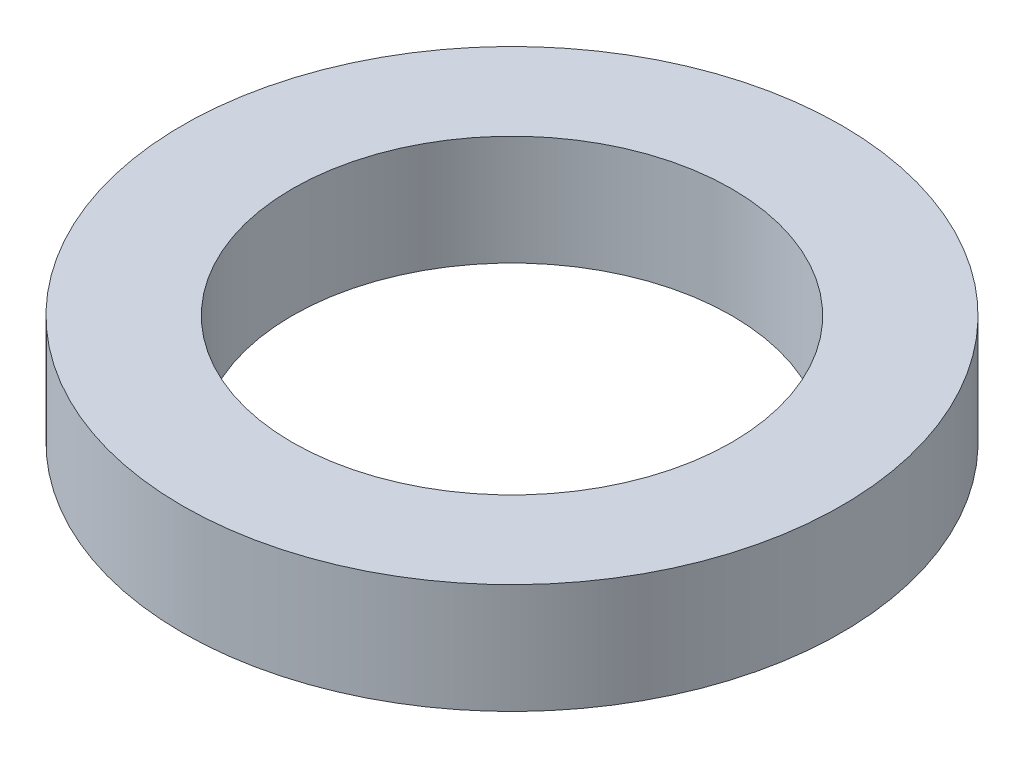
ISO-10303-21;
HEADER;
FILE_DESCRIPTION(('STEP AP214'),'2;1');
FILE_NAME('part.step','',(''),(''),'','','');
FILE_SCHEMA(('AUTOMOTIVE_DESIGN { 1 0 10303 214 1 1 1 1 }'));
ENDSEC;
DATA;
#1=APPLICATION_CONTEXT('core data for automotive mechanical design processes');
#2=APPLICATION_PROTOCOL_DEFINITION('international standard','automotive_design',2000,#1);
#3=PRODUCT_CONTEXT('',#1,'mechanical');
#4=PRODUCT('Part','Part','',(#3));
#5=PRODUCT_RELATED_PRODUCT_CATEGORY('part','',(#4));
#6=PRODUCT_DEFINITION_FORMATION('','',#4);
#7=PRODUCT_DEFINITION_CONTEXT('part definition',#1,'design');
#8=PRODUCT_DEFINITION('design','',#6,#7);
#9=PRODUCT_DEFINITION_SHAPE('','',#8);
#10=(LENGTH_UNIT() NAMED_UNIT(*) SI_UNIT(.MILLI.,.METRE.));
#11=(NAMED_UNIT(*) PLANE_ANGLE_UNIT() SI_UNIT($,.RADIAN.));
#12=(NAMED_UNIT(*) SI_UNIT($,.STERADIAN.) SOLID_ANGLE_UNIT());
#13=UNCERTAINTY_MEASURE_WITH_UNIT(LENGTH_MEASURE(1.E-05),#10,'distance_accuracy_value','');
#14=(GEOMETRIC_REPRESENTATION_CONTEXT(3) GLOBAL_UNCERTAINTY_ASSIGNED_CONTEXT((#13)) GLOBAL_UNIT_ASSIGNED_CONTEXT((#10,
#11,#12)) REPRESENTATION_CONTEXT('',''));
#15=CARTESIAN_POINT('',(0.,0.,0.));
#16=DIRECTION('',(0.,0.,1.));
#17=DIRECTION('',(1.,0.,0.));
#18=AXIS2_PLACEMENT_3D('',#15,#16,#17);
#19=CARTESIAN_POINT('',(0.,3.175,0.));
#20=DIRECTION('',(0.,-1.,0.));
#21=DIRECTION('',(0.,0.,-1.));
#22=AXIS2_PLACEMENT_3D('',#19,#20,#21);
#23=CYLINDRICAL_SURFACE('',#22,9.525);
#24=CARTESIAN_POINT('',(0.,3.175,0.));
#25=DIRECTION('',(0.,1.,0.));
#26=DIRECTION('',(0.,0.,1.));
#27=AXIS2_PLACEMENT_3D('',#24,#25,#26);
#28=CIRCLE('',#27,9.525);
#29=CARTESIAN_POINT('',(0.,3.175,9.525));
#30=VERTEX_POINT('',#29);
#31=EDGE_CURVE('E10',#30,#30,#28,.T.);
#32=ORIENTED_EDGE('',*,*,#31,.F.);
#33=EDGE_LOOP('',(#32));
#34=FACE_BOUND('',#33,.T.);
#35=CARTESIAN_POINT('',(0.,0.,0.));
#36=DIRECTION('',(0.,1.,0.));
#37=DIRECTION('',(0.,0.,1.));
#38=AXIS2_PLACEMENT_3D('',#35,#36,#37);
#39=CIRCLE('',#38,9.525);
#40=CARTESIAN_POINT('',(0.,0.,9.525));
#41=VERTEX_POINT('',#40);
#42=EDGE_CURVE('E33',#41,#41,#39,.T.);
#43=ORIENTED_EDGE('',*,*,#42,.T.);
#44=EDGE_LOOP('',(#43));
#45=FACE_BOUND('',#44,.T.);
#46=ADVANCED_FACE('F30',(#34,#45),#23,.T.);
#47=CARTESIAN_POINT('',(0.,3.175,0.));
#48=DIRECTION('',(0.,1.,0.));
#49=DIRECTION('',(0.,0.,1.));
#50=AXIS2_PLACEMENT_3D('',#47,#48,#49);
#51=PLANE('',#50);
#52=CARTESIAN_POINT('',(0.,3.175,0.));
#53=DIRECTION('',(0.,1.,0.));
#54=DIRECTION('',(0.,0.,1.));
#55=AXIS2_PLACEMENT_3D('',#52,#53,#54);
#56=CIRCLE('',#55,6.35);
#57=CARTESIAN_POINT('',(0.,3.175,6.35));
#58=VERTEX_POINT('',#57);
#59=EDGE_CURVE('E42',#58,#58,#56,.T.);
#60=ORIENTED_EDGE('',*,*,#59,.F.);
#61=EDGE_LOOP('',(#60));
#62=FACE_BOUND('',#61,.T.);
#63=ORIENTED_EDGE('',*,*,#31,.T.);
#64=EDGE_LOOP('',(#63));
#65=FACE_BOUND('',#64,.T.);
#66=ADVANCED_FACE('F57',(#62,#65),#51,.T.);
#67=CARTESIAN_POINT('',(0.,0.,0.));
#68=DIRECTION('',(0.,1.,0.));
#69=DIRECTION('',(0.,0.,1.));
#70=AXIS2_PLACEMENT_3D('',#67,#68,#69);
#71=PLANE('',#70);
#72=CARTESIAN_POINT('',(0.,0.,0.));
#73=DIRECTION('',(0.,1.,0.));
#74=DIRECTION('',(0.,0.,1.));
#75=AXIS2_PLACEMENT_3D('',#72,#73,#74);
#76=CIRCLE('',#75,6.35);
#77=CARTESIAN_POINT('',(0.,0.,6.35));
#78=VERTEX_POINT('',#77);
#79=EDGE_CURVE('E40',#78,#78,#76,.T.);
#80=ORIENTED_EDGE('',*,*,#79,.T.);
#81=EDGE_LOOP('',(#80));
#82=FACE_BOUND('',#81,.T.);
#83=ORIENTED_EDGE('',*,*,#42,.F.);
#84=EDGE_LOOP('',(#83));
#85=FACE_BOUND('',#84,.T.);
#86=ADVANCED_FACE('F48',(#82,#85),#71,.F.);
#87=CARTESIAN_POINT('',(0.,0.,0.));
#88=DIRECTION('',(0.,1.,0.));
#89=DIRECTION('',(0.,0.,1.));
#90=AXIS2_PLACEMENT_3D('',#87,#88,#89);
#91=CYLINDRICAL_SURFACE('',#90,6.35);
#92=ORIENTED_EDGE('',*,*,#79,.F.);
#93=EDGE_LOOP('',(#92));
#94=FACE_BOUND('',#93,.T.);
#95=ORIENTED_EDGE('',*,*,#59,.T.);
#96=EDGE_LOOP('',(#95));
#97=FACE_BOUND('',#96,.T.);
#98=ADVANCED_FACE('F51',(#94,#97),#91,.F.);
#99=CLOSED_SHELL('',(#46,#66,#86,#98));
#100=MANIFOLD_SOLID_BREP('B2',#99);
#101=ADVANCED_BREP_SHAPE_REPRESENTATION('',(#18,#100),#14);
#102=SHAPE_DEFINITION_REPRESENTATION(#9,#101);
ENDSEC;
END-ISO-10303-21;
